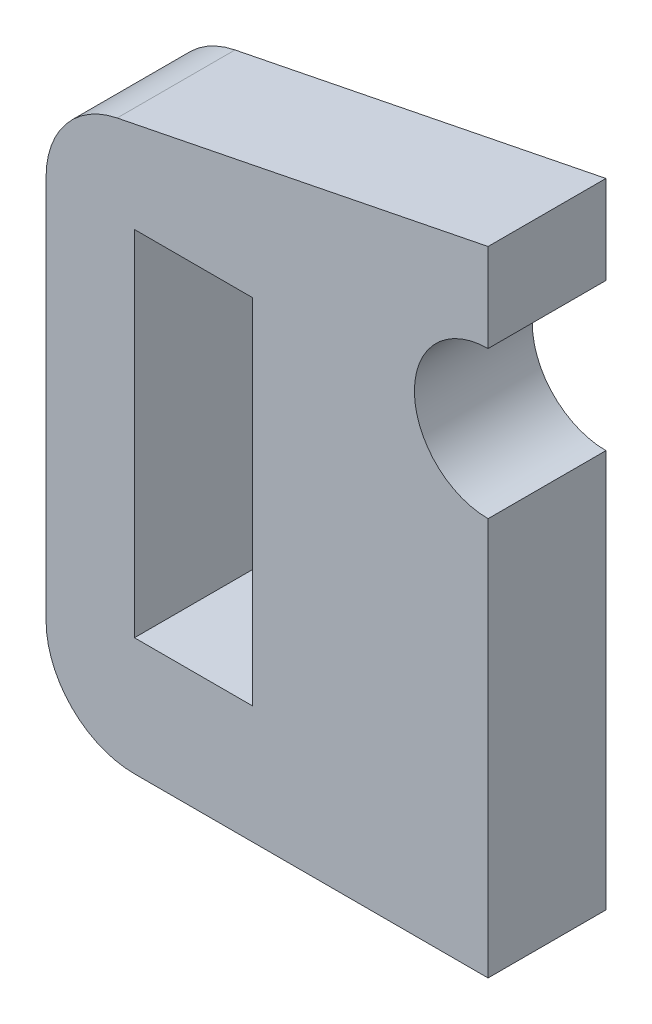
ISO-10303-21;
HEADER;
FILE_DESCRIPTION(('STEP AP214'),'2;1');
FILE_NAME('part.step','',(''),(''),'','','');
FILE_SCHEMA(('AUTOMOTIVE_DESIGN { 1 0 10303 214 1 1 1 1 }'));
ENDSEC;
DATA;
#1=APPLICATION_CONTEXT('core data for automotive mechanical design processes');
#2=APPLICATION_PROTOCOL_DEFINITION('international standard','automotive_design',2000,#1);
#3=PRODUCT_CONTEXT('',#1,'mechanical');
#4=PRODUCT('Part','Part','',(#3));
#5=PRODUCT_RELATED_PRODUCT_CATEGORY('part','',(#4));
#6=PRODUCT_DEFINITION_FORMATION('','',#4);
#7=PRODUCT_DEFINITION_CONTEXT('part definition',#1,'design');
#8=PRODUCT_DEFINITION('design','',#6,#7);
#9=PRODUCT_DEFINITION_SHAPE('','',#8);
#10=(LENGTH_UNIT() NAMED_UNIT(*) SI_UNIT(.MILLI.,.METRE.));
#11=(NAMED_UNIT(*) PLANE_ANGLE_UNIT() SI_UNIT($,.RADIAN.));
#12=(NAMED_UNIT(*) SI_UNIT($,.STERADIAN.) SOLID_ANGLE_UNIT());
#13=UNCERTAINTY_MEASURE_WITH_UNIT(LENGTH_MEASURE(1.E-05),#10,'distance_accuracy_value','');
#14=(GEOMETRIC_REPRESENTATION_CONTEXT(3) GLOBAL_UNCERTAINTY_ASSIGNED_CONTEXT((#13)) GLOBAL_UNIT_ASSIGNED_CONTEXT((#10,
#11,#12)) REPRESENTATION_CONTEXT('',''));
#15=CARTESIAN_POINT('',(0.,0.,0.));
#16=DIRECTION('',(0.,0.,1.));
#17=DIRECTION('',(1.,0.,0.));
#18=AXIS2_PLACEMENT_3D('',#15,#16,#17);
#19=CARTESIAN_POINT('',(0.,-12.,4.));
#20=DIRECTION('',(0.,-1.,0.));
#21=DIRECTION('',(0.,0.,-1.));
#22=AXIS2_PLACEMENT_3D('',#19,#20,#21);
#23=PLANE('',#22);
#24=DIRECTION('',(-1.,0.,0.));
#25=VECTOR('',#24,1.);
#26=CARTESIAN_POINT('',(0.,-12.,0.));
#27=LINE('',#26,#25);
#28=CARTESIAN_POINT('',(-8.,-12.,0.));
#29=VERTEX_POINT('',#28);
#30=CARTESIAN_POINT('',(-12.,-12.,0.));
#31=VERTEX_POINT('',#30);
#32=EDGE_CURVE('E203',#29,#31,#27,.T.);
#33=ORIENTED_EDGE('',*,*,#32,.T.);
#34=DIRECTION('',(0.,0.,-1.));
#35=VECTOR('',#34,1.);
#36=CARTESIAN_POINT('',(-12.,-12.,4.));
#37=LINE('',#36,#35);
#38=CARTESIAN_POINT('',(-12.,-12.,4.));
#39=VERTEX_POINT('',#38);
#40=EDGE_CURVE('E222',#39,#31,#37,.T.);
#41=ORIENTED_EDGE('',*,*,#40,.F.);
#42=DIRECTION('',(-1.,0.,0.));
#43=VECTOR('',#42,1.);
#44=CARTESIAN_POINT('',(0.,-12.,4.));
#45=LINE('',#44,#43);
#46=CARTESIAN_POINT('',(-8.,-12.,4.));
#47=VERTEX_POINT('',#46);
#48=EDGE_CURVE('E172',#47,#39,#45,.T.);
#49=ORIENTED_EDGE('',*,*,#48,.F.);
#50=DIRECTION('',(0.,0.,-1.));
#51=VECTOR('',#50,1.);
#52=CARTESIAN_POINT('',(-8.,-12.,4.));
#53=LINE('',#52,#51);
#54=EDGE_CURVE('E140',#47,#29,#53,.T.);
#55=ORIENTED_EDGE('',*,*,#54,.T.);
#56=EDGE_LOOP('',(#33,#41,#49,#55));
#57=FACE_BOUND('',#56,.T.);
#58=ADVANCED_FACE('F38',(#57),#23,.F.);
#59=CARTESIAN_POINT('',(-12.,0.,4.));
#60=DIRECTION('',(-1.,0.,0.));
#61=DIRECTION('',(0.,0.,1.));
#62=AXIS2_PLACEMENT_3D('',#59,#60,#61);
#63=PLANE('',#62);
#64=DIRECTION('',(0.,1.,0.));
#65=VECTOR('',#64,1.);
#66=CARTESIAN_POINT('',(-12.,0.,0.));
#67=LINE('',#66,#65);
#68=CARTESIAN_POINT('',(-12.,0.,0.));
#69=VERTEX_POINT('',#68);
#70=EDGE_CURVE('E207',#31,#69,#67,.T.);
#71=ORIENTED_EDGE('',*,*,#70,.T.);
#72=DIRECTION('',(0.,0.,-1.));
#73=VECTOR('',#72,1.);
#74=CARTESIAN_POINT('',(-12.,0.,4.));
#75=LINE('',#74,#73);
#76=CARTESIAN_POINT('',(-12.,0.,4.));
#77=VERTEX_POINT('',#76);
#78=EDGE_CURVE('E219',#77,#69,#75,.T.);
#79=ORIENTED_EDGE('',*,*,#78,.F.);
#80=DIRECTION('',(0.,1.,0.));
#81=VECTOR('',#80,1.);
#82=CARTESIAN_POINT('',(-12.,0.,4.));
#83=LINE('',#82,#81);
#84=EDGE_CURVE('E176',#39,#77,#83,.T.);
#85=ORIENTED_EDGE('',*,*,#84,.F.);
#86=ORIENTED_EDGE('',*,*,#40,.T.);
#87=EDGE_LOOP('',(#71,#79,#85,#86));
#88=FACE_BOUND('',#87,.T.);
#89=ADVANCED_FACE('F285',(#88),#63,.F.);
#90=CARTESIAN_POINT('',(0.,0.,4.));
#91=DIRECTION('',(0.,-1.,0.));
#92=DIRECTION('',(1.,0.,0.));
#93=AXIS2_PLACEMENT_3D('',#90,#91,#92);
#94=PLANE('',#93);
#95=DIRECTION('',(-1.,0.,0.));
#96=VECTOR('',#95,1.);
#97=CARTESIAN_POINT('',(0.,0.,0.));
#98=LINE('',#97,#96);
#99=CARTESIAN_POINT('',(-8.,0.,0.));
#100=VERTEX_POINT('',#99);
#101=EDGE_CURVE('E161',#100,#69,#98,.T.);
#102=ORIENTED_EDGE('',*,*,#101,.F.);
#103=DIRECTION('',(0.,0.,-1.));
#104=VECTOR('',#103,1.);
#105=CARTESIAN_POINT('',(-8.,0.,4.));
#106=LINE('',#105,#104);
#107=CARTESIAN_POINT('',(-8.,0.,4.));
#108=VERTEX_POINT('',#107);
#109=EDGE_CURVE('E216',#108,#100,#106,.T.);
#110=ORIENTED_EDGE('',*,*,#109,.F.);
#111=DIRECTION('',(-1.,0.,0.));
#112=VECTOR('',#111,1.);
#113=CARTESIAN_POINT('',(0.,0.,4.));
#114=LINE('',#113,#112);
#115=EDGE_CURVE('E179',#108,#77,#114,.T.);
#116=ORIENTED_EDGE('',*,*,#115,.T.);
#117=ORIENTED_EDGE('',*,*,#78,.T.);
#118=EDGE_LOOP('',(#102,#110,#116,#117));
#119=FACE_BOUND('',#118,.T.);
#120=ADVANCED_FACE('F291',(#119),#94,.T.);
#121=CARTESIAN_POINT('',(0.,0.,4.));
#122=DIRECTION('',(0.,0.,-1.));
#123=DIRECTION('',(-1.,0.,0.));
#124=AXIS2_PLACEMENT_3D('',#121,#122,#123);
#125=CYLINDRICAL_SURFACE('',#124,2.5);
#126=CARTESIAN_POINT('',(0.,0.,0.));
#127=DIRECTION('',(0.,0.,1.));
#128=DIRECTION('',(1.,0.,0.));
#129=AXIS2_PLACEMENT_3D('',#126,#127,#128);
#130=CIRCLE('',#129,2.5);
#131=CARTESIAN_POINT('',(0.,2.5,0.));
#132=VERTEX_POINT('',#131);
#133=CARTESIAN_POINT('',(0.,-2.5,0.));
#134=VERTEX_POINT('',#133);
#135=EDGE_CURVE('E136',#132,#134,#130,.T.);
#136=ORIENTED_EDGE('',*,*,#135,.F.);
#137=DIRECTION('',(0.,0.,-1.));
#138=VECTOR('',#137,1.);
#139=CARTESIAN_POINT('',(0.,2.5,4.));
#140=LINE('',#139,#138);
#141=CARTESIAN_POINT('',(0.,2.5,4.));
#142=VERTEX_POINT('',#141);
#143=EDGE_CURVE('E130',#142,#132,#140,.T.);
#144=ORIENTED_EDGE('',*,*,#143,.F.);
#145=CARTESIAN_POINT('',(0.,0.,4.));
#146=DIRECTION('',(0.,0.,1.));
#147=DIRECTION('',(1.,0.,0.));
#148=AXIS2_PLACEMENT_3D('',#145,#146,#147);
#149=CIRCLE('',#148,2.5);
#150=CARTESIAN_POINT('',(0.,-2.5,4.));
#151=VERTEX_POINT('',#150);
#152=EDGE_CURVE('E134',#142,#151,#149,.T.);
#153=ORIENTED_EDGE('',*,*,#152,.T.);
#154=DIRECTION('',(0.,0.,-1.));
#155=VECTOR('',#154,1.);
#156=CARTESIAN_POINT('',(0.,-2.5,4.));
#157=LINE('',#156,#155);
#158=EDGE_CURVE('E187',#151,#134,#157,.T.);
#159=ORIENTED_EDGE('',*,*,#158,.T.);
#160=EDGE_LOOP('',(#136,#144,#153,#159));
#161=FACE_BOUND('',#160,.T.);
#162=ADVANCED_FACE('F132',(#161),#125,.F.);
#163=CARTESIAN_POINT('',(0.,0.,4.));
#164=DIRECTION('',(-1.,0.,0.));
#165=DIRECTION('',(0.,0.,1.));
#166=AXIS2_PLACEMENT_3D('',#163,#164,#165);
#167=PLANE('',#166);
#168=DIRECTION('',(0.,1.,0.));
#169=VECTOR('',#168,1.);
#170=CARTESIAN_POINT('',(0.,0.,0.));
#171=LINE('',#170,#169);
#172=CARTESIAN_POINT('',(0.,5.5,0.));
#173=VERTEX_POINT('',#172);
#174=EDGE_CURVE('E190',#132,#173,#171,.T.);
#175=ORIENTED_EDGE('',*,*,#174,.T.);
#176=DIRECTION('',(0.,0.,-1.));
#177=VECTOR('',#176,1.);
#178=CARTESIAN_POINT('',(0.,5.5,4.));
#179=LINE('',#178,#177);
#180=CARTESIAN_POINT('',(0.,5.5,4.));
#181=VERTEX_POINT('',#180);
#182=EDGE_CURVE('E141',#181,#173,#179,.T.);
#183=ORIENTED_EDGE('',*,*,#182,.F.);
#184=DIRECTION('',(0.,1.,0.));
#185=VECTOR('',#184,1.);
#186=CARTESIAN_POINT('',(0.,0.,4.));
#187=LINE('',#186,#185);
#188=EDGE_CURVE('E144',#142,#181,#187,.T.);
#189=ORIENTED_EDGE('',*,*,#188,.F.);
#190=ORIENTED_EDGE('',*,*,#143,.T.);
#191=EDGE_LOOP('',(#175,#183,#189,#190));
#192=FACE_BOUND('',#191,.T.);
#193=ADVANCED_FACE('F145',(#192),#167,.F.);
#194=CARTESIAN_POINT('',(-1.05769230769231,5.28846153846154,4.));
#195=DIRECTION('',(0.196116135138184,-0.98058067569092,0.));
#196=DIRECTION('',(0.98058067569092,0.196116135138184,0.));
#197=AXIS2_PLACEMENT_3D('',#194,#195,#196);
#198=PLANE('',#197);
#199=DIRECTION('',(-0.98058067569092,-0.196116135138184,0.));
#200=VECTOR('',#199,1.);
#201=CARTESIAN_POINT('',(-1.05769230769231,5.28846153846154,0.));
#202=LINE('',#201,#200);
#203=CARTESIAN_POINT('',(-12.5883484054146,2.98233031891709,0.));
#204=VERTEX_POINT('',#203);
#205=EDGE_CURVE('E193',#173,#204,#202,.T.);
#206=ORIENTED_EDGE('',*,*,#205,.T.);
#207=DIRECTION('',(0.,0.,-1.));
#208=VECTOR('',#207,1.);
#209=CARTESIAN_POINT('',(-12.5883484054145,2.98233031891709,4.));
#210=LINE('',#209,#208);
#211=CARTESIAN_POINT('',(-12.5883484054146,2.98233031891709,4.));
#212=VERTEX_POINT('',#211);
#213=EDGE_CURVE('E11',#204,#212,#210,.F.);
#214=ORIENTED_EDGE('',*,*,#213,.T.);
#215=DIRECTION('',(-0.98058067569092,-0.196116135138184,0.));
#216=VECTOR('',#215,1.);
#217=CARTESIAN_POINT('',(-1.05769230769231,5.28846153846154,4.));
#218=LINE('',#217,#216);
#219=EDGE_CURVE('E149',#181,#212,#218,.T.);
#220=ORIENTED_EDGE('',*,*,#219,.F.);
#221=ORIENTED_EDGE('',*,*,#182,.T.);
#222=EDGE_LOOP('',(#206,#214,#220,#221));
#223=FACE_BOUND('',#222,.T.);
#224=ADVANCED_FACE('F272',(#223),#198,.F.);
#225=CARTESIAN_POINT('',(-15.,0.,4.));
#226=DIRECTION('',(1.,0.,0.));
#227=DIRECTION('',(0.,1.,0.));
#228=AXIS2_PLACEMENT_3D('',#225,#226,#227);
#229=PLANE('',#228);
#230=DIRECTION('',(0.,-1.,0.));
#231=VECTOR('',#230,1.);
#232=CARTESIAN_POINT('',(-15.,0.,0.));
#233=LINE('',#232,#231);
#234=CARTESIAN_POINT('',(-15.,0.0405882918443286,0.));
#235=VERTEX_POINT('',#234);
#236=CARTESIAN_POINT('',(-15.,-13.,0.));
#237=VERTEX_POINT('',#236);
#238=EDGE_CURVE('E197',#235,#237,#233,.T.);
#239=ORIENTED_EDGE('',*,*,#238,.T.);
#240=DIRECTION('',(0.,0.,-1.));
#241=VECTOR('',#240,1.);
#242=CARTESIAN_POINT('',(-15.,-13.,4.));
#243=LINE('',#242,#241);
#244=CARTESIAN_POINT('',(-15.,-13.,4.));
#245=VERTEX_POINT('',#244);
#246=EDGE_CURVE('E60',#237,#245,#243,.F.);
#247=ORIENTED_EDGE('',*,*,#246,.T.);
#248=DIRECTION('',(0.,-1.,0.));
#249=VECTOR('',#248,1.);
#250=CARTESIAN_POINT('',(-15.,0.,4.));
#251=LINE('',#250,#249);
#252=CARTESIAN_POINT('',(-15.,0.0405882918443286,4.));
#253=VERTEX_POINT('',#252);
#254=EDGE_CURVE('E166',#253,#245,#251,.T.);
#255=ORIENTED_EDGE('',*,*,#254,.F.);
#256=DIRECTION('',(0.,0.,-1.));
#257=VECTOR('',#256,1.);
#258=CARTESIAN_POINT('',(-15.,0.0405882918443286,4.));
#259=LINE('',#258,#257);
#260=EDGE_CURVE('E244',#253,#235,#259,.T.);
#261=ORIENTED_EDGE('',*,*,#260,.T.);
#262=EDGE_LOOP('',(#239,#247,#255,#261));
#263=FACE_BOUND('',#262,.T.);
#264=ADVANCED_FACE('F267',(#263),#229,.F.);
#265=CARTESIAN_POINT('',(0.,-16.,4.));
#266=DIRECTION('',(0.,1.,0.));
#267=DIRECTION('',(0.,0.,1.));
#268=AXIS2_PLACEMENT_3D('',#265,#266,#267);
#269=PLANE('',#268);
#270=DIRECTION('',(1.,0.,0.));
#271=VECTOR('',#270,1.);
#272=CARTESIAN_POINT('',(0.,-16.,4.));
#273=LINE('',#272,#271);
#274=CARTESIAN_POINT('',(-12.,-16.,4.));
#275=VERTEX_POINT('',#274);
#276=CARTESIAN_POINT('',(0.,-16.,4.));
#277=VERTEX_POINT('',#276);
#278=EDGE_CURVE('E169',#275,#277,#273,.T.);
#279=ORIENTED_EDGE('',*,*,#278,.F.);
#280=DIRECTION('',(0.,0.,-1.));
#281=VECTOR('',#280,1.);
#282=CARTESIAN_POINT('',(-12.,-16.,4.));
#283=LINE('',#282,#281);
#284=CARTESIAN_POINT('',(-12.,-16.,0.));
#285=VERTEX_POINT('',#284);
#286=EDGE_CURVE('E226',#275,#285,#283,.T.);
#287=ORIENTED_EDGE('',*,*,#286,.T.);
#288=DIRECTION('',(1.,0.,0.));
#289=VECTOR('',#288,1.);
#290=CARTESIAN_POINT('',(0.,-16.,0.));
#291=LINE('',#290,#289);
#292=CARTESIAN_POINT('',(0.,-16.,0.));
#293=VERTEX_POINT('',#292);
#294=EDGE_CURVE('E200',#285,#293,#291,.T.);
#295=ORIENTED_EDGE('',*,*,#294,.T.);
#296=DIRECTION('',(0.,0.,-1.));
#297=VECTOR('',#296,1.);
#298=CARTESIAN_POINT('',(0.,-16.,4.));
#299=LINE('',#298,#297);
#300=EDGE_CURVE('E229',#277,#293,#299,.T.);
#301=ORIENTED_EDGE('',*,*,#300,.F.);
#302=EDGE_LOOP('',(#279,#287,#295,#301));
#303=FACE_BOUND('',#302,.T.);
#304=ADVANCED_FACE('F259',(#303),#269,.F.);
#305=EDGE_CURVE('E194',#293,#134,#171,.T.);
#306=ORIENTED_EDGE('',*,*,#305,.T.);
#307=ORIENTED_EDGE('',*,*,#158,.F.);
#308=EDGE_CURVE('E151',#277,#151,#187,.T.);
#309=ORIENTED_EDGE('',*,*,#308,.F.);
#310=ORIENTED_EDGE('',*,*,#300,.T.);
#311=EDGE_LOOP('',(#306,#307,#309,#310));
#312=FACE_BOUND('',#311,.T.);
#313=ADVANCED_FACE('F282',(#312),#167,.F.);
#314=CARTESIAN_POINT('',(-8.,0.,4.));
#315=DIRECTION('',(-1.,0.,0.));
#316=DIRECTION('',(0.,0.,1.));
#317=AXIS2_PLACEMENT_3D('',#314,#315,#316);
#318=PLANE('',#317);
#319=DIRECTION('',(0.,1.,0.));
#320=VECTOR('',#319,1.);
#321=CARTESIAN_POINT('',(-8.,0.,0.));
#322=LINE('',#321,#320);
#323=EDGE_CURVE('E157',#29,#100,#322,.T.);
#324=ORIENTED_EDGE('',*,*,#323,.F.);
#325=ORIENTED_EDGE('',*,*,#54,.F.);
#326=DIRECTION('',(0.,1.,0.));
#327=VECTOR('',#326,1.);
#328=CARTESIAN_POINT('',(-8.,0.,4.));
#329=LINE('',#328,#327);
#330=EDGE_CURVE('E183',#47,#108,#329,.T.);
#331=ORIENTED_EDGE('',*,*,#330,.T.);
#332=ORIENTED_EDGE('',*,*,#109,.T.);
#333=EDGE_LOOP('',(#324,#325,#331,#332));
#334=FACE_BOUND('',#333,.T.);
#335=ADVANCED_FACE('F297',(#334),#318,.T.);
#336=CARTESIAN_POINT('',(0.,0.,4.));
#337=DIRECTION('',(0.,0.,1.));
#338=DIRECTION('',(1.,0.,0.));
#339=AXIS2_PLACEMENT_3D('',#336,#337,#338);
#340=PLANE('',#339);
#341=ORIENTED_EDGE('',*,*,#254,.T.);
#342=CARTESIAN_POINT('',(-12.,-13.,4.));
#343=DIRECTION('',(0.,0.,1.));
#344=DIRECTION('',(1.,0.,0.));
#345=AXIS2_PLACEMENT_3D('',#342,#343,#344);
#346=CIRCLE('',#345,3.);
#347=EDGE_CURVE('E47',#245,#275,#346,.T.);
#348=ORIENTED_EDGE('',*,*,#347,.T.);
#349=ORIENTED_EDGE('',*,*,#278,.T.);
#350=ORIENTED_EDGE('',*,*,#308,.T.);
#351=ORIENTED_EDGE('',*,*,#152,.F.);
#352=ORIENTED_EDGE('',*,*,#188,.T.);
#353=ORIENTED_EDGE('',*,*,#219,.T.);
#354=CARTESIAN_POINT('',(-12.,0.0405882918443289,4.));
#355=DIRECTION('',(0.,0.,1.));
#356=DIRECTION('',(1.,0.,0.));
#357=AXIS2_PLACEMENT_3D('',#354,#355,#356);
#358=CIRCLE('',#357,3.);
#359=EDGE_CURVE('E250',#212,#253,#358,.T.);
#360=ORIENTED_EDGE('',*,*,#359,.T.);
#361=EDGE_LOOP('',(#341,#348,#349,#350,#351,#352,#353,#360));
#362=FACE_BOUND('',#361,.T.);
#363=ORIENTED_EDGE('',*,*,#48,.T.);
#364=ORIENTED_EDGE('',*,*,#84,.T.);
#365=ORIENTED_EDGE('',*,*,#115,.F.);
#366=ORIENTED_EDGE('',*,*,#330,.F.);
#367=EDGE_LOOP('',(#363,#364,#365,#366));
#368=FACE_BOUND('',#367,.T.);
#369=ADVANCED_FACE('F152',(#362,#368),#340,.T.);
#370=CARTESIAN_POINT('',(0.,0.,0.));
#371=DIRECTION('',(0.,0.,1.));
#372=DIRECTION('',(1.,0.,0.));
#373=AXIS2_PLACEMENT_3D('',#370,#371,#372);
#374=PLANE('',#373);
#375=ORIENTED_EDGE('',*,*,#294,.F.);
#376=CARTESIAN_POINT('',(-12.,-13.,0.));
#377=DIRECTION('',(0.,0.,1.));
#378=DIRECTION('',(1.,0.,0.));
#379=AXIS2_PLACEMENT_3D('',#376,#377,#378);
#380=CIRCLE('',#379,3.);
#381=EDGE_CURVE('E241',#285,#237,#380,.F.);
#382=ORIENTED_EDGE('',*,*,#381,.T.);
#383=ORIENTED_EDGE('',*,*,#238,.F.);
#384=CARTESIAN_POINT('',(-12.,0.0405882918443289,0.));
#385=DIRECTION('',(0.,0.,1.));
#386=DIRECTION('',(1.,0.,0.));
#387=AXIS2_PLACEMENT_3D('',#384,#385,#386);
#388=CIRCLE('',#387,3.);
#389=EDGE_CURVE('E238',#235,#204,#388,.F.);
#390=ORIENTED_EDGE('',*,*,#389,.T.);
#391=ORIENTED_EDGE('',*,*,#205,.F.);
#392=ORIENTED_EDGE('',*,*,#174,.F.);
#393=ORIENTED_EDGE('',*,*,#135,.T.);
#394=ORIENTED_EDGE('',*,*,#305,.F.);
#395=EDGE_LOOP('',(#375,#382,#383,#390,#391,#392,#393,#394));
#396=FACE_BOUND('',#395,.T.);
#397=ORIENTED_EDGE('',*,*,#32,.F.);
#398=ORIENTED_EDGE('',*,*,#323,.T.);
#399=ORIENTED_EDGE('',*,*,#101,.T.);
#400=ORIENTED_EDGE('',*,*,#70,.F.);
#401=EDGE_LOOP('',(#397,#398,#399,#400));
#402=FACE_BOUND('',#401,.T.);
#403=ADVANCED_FACE('F264',(#396,#402),#374,.F.);
#404=CARTESIAN_POINT('',(-12.,-13.,4.));
#405=DIRECTION('',(0.,0.,-1.));
#406=DIRECTION('',(-1.,0.,0.));
#407=AXIS2_PLACEMENT_3D('',#404,#405,#406);
#408=CYLINDRICAL_SURFACE('',#407,3.);
#409=ORIENTED_EDGE('',*,*,#347,.F.);
#410=ORIENTED_EDGE('',*,*,#246,.F.);
#411=ORIENTED_EDGE('',*,*,#381,.F.);
#412=ORIENTED_EDGE('',*,*,#286,.F.);
#413=EDGE_LOOP('',(#409,#410,#411,#412));
#414=FACE_BOUND('',#413,.T.);
#415=ADVANCED_FACE('F261',(#414),#408,.T.);
#416=CARTESIAN_POINT('',(-12.,0.0405882918443289,4.));
#417=DIRECTION('',(0.,0.,-1.));
#418=DIRECTION('',(-1.,0.,0.));
#419=AXIS2_PLACEMENT_3D('',#416,#417,#418);
#420=CYLINDRICAL_SURFACE('',#419,3.);
#421=ORIENTED_EDGE('',*,*,#359,.F.);
#422=ORIENTED_EDGE('',*,*,#213,.F.);
#423=ORIENTED_EDGE('',*,*,#389,.F.);
#424=ORIENTED_EDGE('',*,*,#260,.F.);
#425=EDGE_LOOP('',(#421,#422,#423,#424));
#426=FACE_BOUND('',#425,.T.);
#427=ADVANCED_FACE('F40',(#426),#420,.T.);
#428=CLOSED_SHELL('',(#58,#89,#120,#162,#193,#224,#264,#304,#313,#335,#369,#403,#415,#427));
#429=MANIFOLD_SOLID_BREP('B2',#428);
#430=ADVANCED_BREP_SHAPE_REPRESENTATION('',(#18,#429),#14);
#431=SHAPE_DEFINITION_REPRESENTATION(#9,#430);
ENDSEC;
END-ISO-10303-21;
